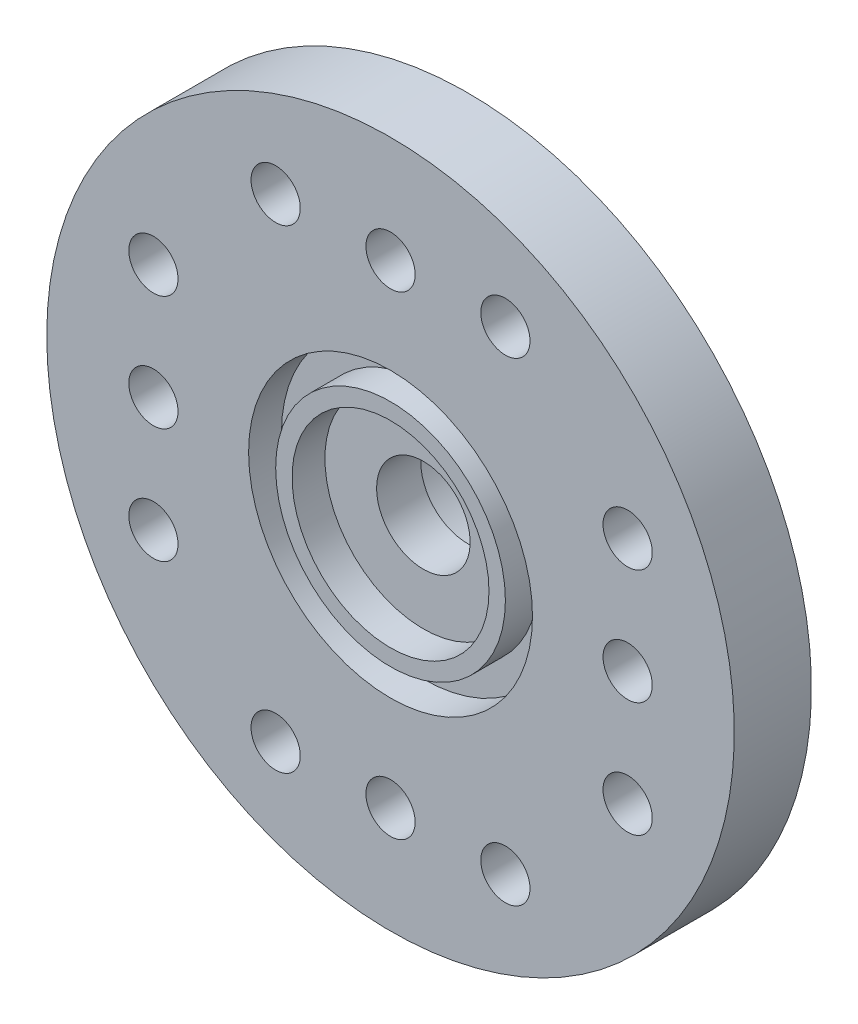
ISO-10303-21;
HEADER;
FILE_DESCRIPTION(('STEP AP214'),'2;1');
FILE_NAME('part.step','',(''),(''),'','','');
FILE_SCHEMA(('AUTOMOTIVE_DESIGN { 1 0 10303 214 1 1 1 1 }'));
ENDSEC;
DATA;
#1=APPLICATION_CONTEXT('core data for automotive mechanical design processes');
#2=APPLICATION_PROTOCOL_DEFINITION('international standard','automotive_design',2000,#1);
#3=PRODUCT_CONTEXT('',#1,'mechanical');
#4=PRODUCT('Part','Part','',(#3));
#5=PRODUCT_RELATED_PRODUCT_CATEGORY('part','',(#4));
#6=PRODUCT_DEFINITION_FORMATION('','',#4);
#7=PRODUCT_DEFINITION_CONTEXT('part definition',#1,'design');
#8=PRODUCT_DEFINITION('design','',#6,#7);
#9=PRODUCT_DEFINITION_SHAPE('','',#8);
#10=(LENGTH_UNIT() NAMED_UNIT(*) SI_UNIT(.MILLI.,.METRE.));
#11=(NAMED_UNIT(*) PLANE_ANGLE_UNIT() SI_UNIT($,.RADIAN.));
#12=(NAMED_UNIT(*) SI_UNIT($,.STERADIAN.) SOLID_ANGLE_UNIT());
#13=UNCERTAINTY_MEASURE_WITH_UNIT(LENGTH_MEASURE(1.E-05),#10,'distance_accuracy_value','');
#14=(GEOMETRIC_REPRESENTATION_CONTEXT(3) GLOBAL_UNCERTAINTY_ASSIGNED_CONTEXT((#13)) GLOBAL_UNIT_ASSIGNED_CONTEXT((#10,
#11,#12)) REPRESENTATION_CONTEXT('',''));
#15=CARTESIAN_POINT('',(0.,0.,0.));
#16=DIRECTION('',(0.,0.,1.));
#17=DIRECTION('',(1.,0.,0.));
#18=AXIS2_PLACEMENT_3D('',#15,#16,#17);
#19=CARTESIAN_POINT('',(0.,0.,2.35));
#20=DIRECTION('',(0.,0.,-1.));
#21=DIRECTION('',(-1.,0.,0.));
#22=AXIS2_PLACEMENT_3D('',#19,#20,#21);
#23=CYLINDRICAL_SURFACE('',#22,1.425);
#24=CARTESIAN_POINT('',(0.,0.,0.));
#25=DIRECTION('',(0.,0.,-1.));
#26=DIRECTION('',(-1.,0.,0.));
#27=AXIS2_PLACEMENT_3D('',#24,#25,#26);
#28=CIRCLE('',#27,1.425);
#29=CARTESIAN_POINT('',(-1.425,0.,0.));
#30=VERTEX_POINT('',#29);
#31=EDGE_CURVE('E18',#30,#30,#28,.T.);
#32=ORIENTED_EDGE('',*,*,#31,.T.);
#33=EDGE_LOOP('',(#32));
#34=FACE_BOUND('',#33,.T.);
#35=CARTESIAN_POINT('',(0.,0.,1.35));
#36=DIRECTION('',(0.,0.,-1.));
#37=DIRECTION('',(-1.,0.,0.));
#38=AXIS2_PLACEMENT_3D('',#35,#36,#37);
#39=CIRCLE('',#38,1.425);
#40=CARTESIAN_POINT('',(-1.425,0.,1.35));
#41=VERTEX_POINT('',#40);
#42=EDGE_CURVE('E132',#41,#41,#39,.T.);
#43=ORIENTED_EDGE('',*,*,#42,.F.);
#44=EDGE_LOOP('',(#43));
#45=FACE_BOUND('',#44,.T.);
#46=ADVANCED_FACE('F15',(#34,#45),#23,.F.);
#47=CARTESIAN_POINT('',(0.,0.,0.));
#48=DIRECTION('',(0.,0.,1.));
#49=DIRECTION('',(1.,0.,0.));
#50=AXIS2_PLACEMENT_3D('',#47,#48,#49);
#51=PLANE('',#50);
#52=ORIENTED_EDGE('',*,*,#31,.F.);
#53=EDGE_LOOP('',(#52));
#54=FACE_BOUND('',#53,.T.);
#55=CARTESIAN_POINT('',(0.,0.,0.));
#56=DIRECTION('',(0.,0.,1.));
#57=DIRECTION('',(1.,0.,0.));
#58=AXIS2_PLACEMENT_3D('',#55,#56,#57);
#59=CIRCLE('',#58,2.65);
#60=CARTESIAN_POINT('',(2.65,0.,0.));
#61=VERTEX_POINT('',#60);
#62=EDGE_CURVE('E130',#61,#61,#59,.F.);
#63=ORIENTED_EDGE('',*,*,#62,.T.);
#64=EDGE_LOOP('',(#63));
#65=FACE_BOUND('',#64,.T.);
#66=ADVANCED_FACE('F141',(#54,#65),#51,.F.);
#67=CARTESIAN_POINT('',(0.,0.,1.35));
#68=DIRECTION('',(0.,0.,1.));
#69=DIRECTION('',(1.,0.,0.));
#70=AXIS2_PLACEMENT_3D('',#67,#68,#69);
#71=PLANE('',#70);
#72=CARTESIAN_POINT('',(0.,0.,1.35));
#73=DIRECTION('',(0.,0.,1.));
#74=DIRECTION('',(1.,0.,0.));
#75=AXIS2_PLACEMENT_3D('',#72,#73,#74);
#76=CIRCLE('',#75,3.);
#77=CARTESIAN_POINT('',(3.,0.,1.35));
#78=VERTEX_POINT('',#77);
#79=EDGE_CURVE('E127',#78,#78,#76,.T.);
#80=ORIENTED_EDGE('',*,*,#79,.T.);
#81=EDGE_LOOP('',(#80));
#82=FACE_BOUND('',#81,.T.);
#83=ORIENTED_EDGE('',*,*,#42,.T.);
#84=EDGE_LOOP('',(#83));
#85=FACE_BOUND('',#84,.T.);
#86=ADVANCED_FACE('F144',(#82,#85),#71,.T.);
#87=CARTESIAN_POINT('',(0.,0.,-3.5));
#88=DIRECTION('',(0.,0.,1.));
#89=DIRECTION('',(1.,0.,0.));
#90=AXIS2_PLACEMENT_3D('',#87,#88,#89);
#91=CYLINDRICAL_SURFACE('',#90,2.65);
#92=CARTESIAN_POINT('',(0.,0.,-3.5));
#93=DIRECTION('',(0.,0.,1.));
#94=DIRECTION('',(1.,0.,0.));
#95=AXIS2_PLACEMENT_3D('',#92,#93,#94);
#96=CIRCLE('',#95,2.65);
#97=CARTESIAN_POINT('',(2.65,0.,-3.5));
#98=VERTEX_POINT('',#97);
#99=EDGE_CURVE('E124',#98,#98,#96,.T.);
#100=ORIENTED_EDGE('',*,*,#99,.F.);
#101=EDGE_LOOP('',(#100));
#102=FACE_BOUND('',#101,.T.);
#103=ORIENTED_EDGE('',*,*,#62,.F.);
#104=EDGE_LOOP('',(#103));
#105=FACE_BOUND('',#104,.T.);
#106=ADVANCED_FACE('F147',(#102,#105),#91,.F.);
#107=CARTESIAN_POINT('',(0.,0.,1.35));
#108=DIRECTION('',(0.,0.,1.));
#109=DIRECTION('',(1.,0.,0.));
#110=AXIS2_PLACEMENT_3D('',#107,#108,#109);
#111=CYLINDRICAL_SURFACE('',#110,3.);
#112=CARTESIAN_POINT('',(0.,0.,2.35));
#113=DIRECTION('',(0.,0.,1.));
#114=DIRECTION('',(1.,0.,0.));
#115=AXIS2_PLACEMENT_3D('',#112,#113,#114);
#116=CIRCLE('',#115,3.);
#117=CARTESIAN_POINT('',(3.,0.,2.35));
#118=VERTEX_POINT('',#117);
#119=EDGE_CURVE('E121',#118,#118,#116,.F.);
#120=ORIENTED_EDGE('',*,*,#119,.F.);
#121=EDGE_LOOP('',(#120));
#122=FACE_BOUND('',#121,.T.);
#123=ORIENTED_EDGE('',*,*,#79,.F.);
#124=EDGE_LOOP('',(#123));
#125=FACE_BOUND('',#124,.T.);
#126=ADVANCED_FACE('F149',(#122,#125),#111,.F.);
#127=CARTESIAN_POINT('',(0.,0.,-3.5));
#128=DIRECTION('',(0.,0.,-1.));
#129=DIRECTION('',(-1.,0.,0.));
#130=AXIS2_PLACEMENT_3D('',#127,#128,#129);
#131=PLANE('',#130);
#132=ORIENTED_EDGE('',*,*,#99,.T.);
#133=EDGE_LOOP('',(#132));
#134=FACE_BOUND('',#133,.T.);
#135=CARTESIAN_POINT('',(0.,0.,-3.49999999997408));
#136=DIRECTION('',(0.,0.,1.));
#137=DIRECTION('',(0.,-1.,0.));
#138=AXIS2_PLACEMENT_3D('',#135,#136,#137);
#139=CIRCLE('',#138,4.14999999998145);
#140=CARTESIAN_POINT('',(0.,-4.14999999998145,-3.49999999997408));
#141=VERTEX_POINT('',#140);
#142=EDGE_CURVE('E118',#141,#141,#139,.T.);
#143=ORIENTED_EDGE('',*,*,#142,.F.);
#144=EDGE_LOOP('',(#143));
#145=FACE_BOUND('',#144,.T.);
#146=ADVANCED_FACE('F157',(#134,#145),#131,.T.);
#147=CARTESIAN_POINT('',(0.,0.,2.35));
#148=DIRECTION('',(0.,0.,1.));
#149=DIRECTION('',(1.,0.,0.));
#150=AXIS2_PLACEMENT_3D('',#147,#148,#149);
#151=PLANE('',#150);
#152=CARTESIAN_POINT('',(0.,0.,2.35));
#153=DIRECTION('',(0.,0.,1.));
#154=DIRECTION('',(1.,0.,0.));
#155=AXIS2_PLACEMENT_3D('',#152,#153,#154);
#156=CIRCLE('',#155,3.5);
#157=CARTESIAN_POINT('',(3.5,0.,2.35));
#158=VERTEX_POINT('',#157);
#159=EDGE_CURVE('E115',#158,#158,#156,.F.);
#160=ORIENTED_EDGE('',*,*,#159,.F.);
#161=EDGE_LOOP('',(#160));
#162=FACE_BOUND('',#161,.T.);
#163=ORIENTED_EDGE('',*,*,#119,.T.);
#164=EDGE_LOOP('',(#163));
#165=FACE_BOUND('',#164,.T.);
#166=ADVANCED_FACE('F245',(#162,#165),#151,.T.);
#167=CARTESIAN_POINT('',(0.,0.,-3.24999999992315));
#168=DIRECTION('',(0.,0.,1.));
#169=DIRECTION('',(0.,-1.,0.));
#170=AXIS2_PLACEMENT_3D('',#167,#168,#169);
#171=CONICAL_SURFACE('',#170,4.39999999997553,0.785398163283761);
#172=ORIENTED_EDGE('',*,*,#142,.T.);
#173=EDGE_LOOP('',(#172));
#174=FACE_BOUND('',#173,.T.);
#175=CARTESIAN_POINT('',(0.,0.,-3.25));
#176=DIRECTION('',(0.,0.,1.));
#177=DIRECTION('',(1.,0.,0.));
#178=AXIS2_PLACEMENT_3D('',#175,#176,#177);
#179=CIRCLE('',#178,4.4);
#180=CARTESIAN_POINT('',(4.4,0.,-3.25));
#181=VERTEX_POINT('',#180);
#182=EDGE_CURVE('E30',#181,#181,#179,.T.);
#183=ORIENTED_EDGE('',*,*,#182,.F.);
#184=EDGE_LOOP('',(#183));
#185=FACE_BOUND('',#184,.T.);
#186=ADVANCED_FACE('F241',(#174,#185),#171,.T.);
#187=CARTESIAN_POINT('',(0.,0.,1.35));
#188=DIRECTION('',(0.,0.,1.));
#189=DIRECTION('',(1.,0.,0.));
#190=AXIS2_PLACEMENT_3D('',#187,#188,#189);
#191=CYLINDRICAL_SURFACE('',#190,3.5);
#192=CARTESIAN_POINT('',(0.,0.,1.35));
#193=DIRECTION('',(0.,0.,1.));
#194=DIRECTION('',(1.,0.,0.));
#195=AXIS2_PLACEMENT_3D('',#192,#193,#194);
#196=CIRCLE('',#195,3.5);
#197=CARTESIAN_POINT('',(3.5,0.,1.35));
#198=VERTEX_POINT('',#197);
#199=EDGE_CURVE('E112',#198,#198,#196,.F.);
#200=ORIENTED_EDGE('',*,*,#199,.F.);
#201=EDGE_LOOP('',(#200));
#202=FACE_BOUND('',#201,.T.);
#203=ORIENTED_EDGE('',*,*,#159,.T.);
#204=EDGE_LOOP('',(#203));
#205=FACE_BOUND('',#204,.T.);
#206=ADVANCED_FACE('F237',(#202,#205),#191,.T.);
#207=CARTESIAN_POINT('',(0.,0.,-3.5));
#208=DIRECTION('',(0.,0.,1.));
#209=DIRECTION('',(1.,0.,0.));
#210=AXIS2_PLACEMENT_3D('',#207,#208,#209);
#211=CYLINDRICAL_SURFACE('',#210,4.4);
#212=ORIENTED_EDGE('',*,*,#182,.T.);
#213=EDGE_LOOP('',(#212));
#214=FACE_BOUND('',#213,.T.);
#215=CARTESIAN_POINT('',(0.,0.,0.));
#216=DIRECTION('',(0.,0.,1.));
#217=DIRECTION('',(1.,0.,0.));
#218=AXIS2_PLACEMENT_3D('',#215,#216,#217);
#219=CIRCLE('',#218,4.4);
#220=CARTESIAN_POINT('',(4.4,0.,0.));
#221=VERTEX_POINT('',#220);
#222=EDGE_CURVE('E109',#221,#221,#219,.F.);
#223=ORIENTED_EDGE('',*,*,#222,.T.);
#224=EDGE_LOOP('',(#223));
#225=FACE_BOUND('',#224,.T.);
#226=ADVANCED_FACE('F233',(#214,#225),#211,.T.);
#227=CARTESIAN_POINT('',(0.,0.,1.35));
#228=DIRECTION('',(0.,0.,1.));
#229=DIRECTION('',(1.,0.,0.));
#230=AXIS2_PLACEMENT_3D('',#227,#228,#229);
#231=PLANE('',#230);
#232=CARTESIAN_POINT('',(0.,0.,1.35));
#233=DIRECTION('',(0.,0.,1.));
#234=DIRECTION('',(1.,0.,0.));
#235=AXIS2_PLACEMENT_3D('',#232,#233,#234);
#236=CIRCLE('',#235,4.325);
#237=CARTESIAN_POINT('',(4.325,0.,1.35));
#238=VERTEX_POINT('',#237);
#239=EDGE_CURVE('E106',#238,#238,#236,.T.);
#240=ORIENTED_EDGE('',*,*,#239,.T.);
#241=EDGE_LOOP('',(#240));
#242=FACE_BOUND('',#241,.T.);
#243=ORIENTED_EDGE('',*,*,#199,.T.);
#244=EDGE_LOOP('',(#243));
#245=FACE_BOUND('',#244,.T.);
#246=ADVANCED_FACE('F229',(#242,#245),#231,.T.);
#247=CARTESIAN_POINT('',(0.,0.,0.));
#248=DIRECTION('',(0.,0.,1.));
#249=DIRECTION('',(1.,0.,0.));
#250=AXIS2_PLACEMENT_3D('',#247,#248,#249);
#251=PLANE('',#250);
#252=ORIENTED_EDGE('',*,*,#222,.F.);
#253=EDGE_LOOP('',(#252));
#254=FACE_BOUND('',#253,.T.);
#255=CARTESIAN_POINT('',(0.,7.225,0.));
#256=DIRECTION('',(0.,0.,-1.));
#257=DIRECTION('',(-1.,0.,0.));
#258=AXIS2_PLACEMENT_3D('',#255,#256,#257);
#259=CIRCLE('',#258,0.75);
#260=CARTESIAN_POINT('',(-0.750000000000002,7.225,0.));
#261=VERTEX_POINT('',#260);
#262=EDGE_CURVE('E67',#261,#261,#259,.F.);
#263=ORIENTED_EDGE('',*,*,#262,.T.);
#264=EDGE_LOOP('',(#263));
#265=FACE_BOUND('',#264,.T.);
#266=CARTESIAN_POINT('',(-7.225,3.5,0.));
#267=DIRECTION('',(0.,0.,-1.));
#268=DIRECTION('',(-1.,0.,0.));
#269=AXIS2_PLACEMENT_3D('',#266,#267,#268);
#270=CIRCLE('',#269,0.749999999999998);
#271=CARTESIAN_POINT('',(-7.975,3.5,0.));
#272=VERTEX_POINT('',#271);
#273=EDGE_CURVE('E70',#272,#272,#270,.F.);
#274=ORIENTED_EDGE('',*,*,#273,.T.);
#275=EDGE_LOOP('',(#274));
#276=FACE_BOUND('',#275,.T.);
#277=CARTESIAN_POINT('',(-7.225,-3.5,0.));
#278=DIRECTION('',(0.,0.,-1.));
#279=DIRECTION('',(-1.,0.,0.));
#280=AXIS2_PLACEMENT_3D('',#277,#278,#279);
#281=CIRCLE('',#280,0.749999999999998);
#282=CARTESIAN_POINT('',(-7.975,-3.5,0.));
#283=VERTEX_POINT('',#282);
#284=EDGE_CURVE('E73',#283,#283,#281,.F.);
#285=ORIENTED_EDGE('',*,*,#284,.T.);
#286=EDGE_LOOP('',(#285));
#287=FACE_BOUND('',#286,.T.);
#288=CARTESIAN_POINT('',(0.,-7.225,0.));
#289=DIRECTION('',(0.,0.,-1.));
#290=DIRECTION('',(-1.,0.,0.));
#291=AXIS2_PLACEMENT_3D('',#288,#289,#290);
#292=CIRCLE('',#291,0.749999999999998);
#293=CARTESIAN_POINT('',(-0.749999999999998,-7.225,0.));
#294=VERTEX_POINT('',#293);
#295=EDGE_CURVE('E76',#294,#294,#292,.F.);
#296=ORIENTED_EDGE('',*,*,#295,.T.);
#297=EDGE_LOOP('',(#296));
#298=FACE_BOUND('',#297,.T.);
#299=CARTESIAN_POINT('',(7.225,-3.5,0.));
#300=DIRECTION('',(0.,0.,-1.));
#301=DIRECTION('',(-1.,0.,0.));
#302=AXIS2_PLACEMENT_3D('',#299,#300,#301);
#303=CIRCLE('',#302,0.75);
#304=CARTESIAN_POINT('',(6.475,-3.5,0.));
#305=VERTEX_POINT('',#304);
#306=EDGE_CURVE('E79',#305,#305,#303,.F.);
#307=ORIENTED_EDGE('',*,*,#306,.T.);
#308=EDGE_LOOP('',(#307));
#309=FACE_BOUND('',#308,.T.);
#310=CARTESIAN_POINT('',(7.225,3.5,0.));
#311=DIRECTION('',(0.,0.,-1.));
#312=DIRECTION('',(-1.,0.,0.));
#313=AXIS2_PLACEMENT_3D('',#310,#311,#312);
#314=CIRCLE('',#313,0.75);
#315=CARTESIAN_POINT('',(6.475,3.5,0.));
#316=VERTEX_POINT('',#315);
#317=EDGE_CURVE('E82',#316,#316,#314,.F.);
#318=ORIENTED_EDGE('',*,*,#317,.T.);
#319=EDGE_LOOP('',(#318));
#320=FACE_BOUND('',#319,.T.);
#321=CARTESIAN_POINT('',(0.,0.,0.));
#322=DIRECTION('',(0.,0.,-1.));
#323=DIRECTION('',(-1.,0.,0.));
#324=AXIS2_PLACEMENT_3D('',#321,#322,#323);
#325=CIRCLE('',#324,10.475);
#326=CARTESIAN_POINT('',(-10.475,0.,0.));
#327=VERTEX_POINT('',#326);
#328=EDGE_CURVE('E85',#327,#327,#325,.F.);
#329=ORIENTED_EDGE('',*,*,#328,.F.);
#330=EDGE_LOOP('',(#329));
#331=FACE_BOUND('',#330,.T.);
#332=CARTESIAN_POINT('',(7.225,0.,0.));
#333=DIRECTION('',(0.,0.,-1.));
#334=DIRECTION('',(-1.,0.,0.));
#335=AXIS2_PLACEMENT_3D('',#332,#333,#334);
#336=CIRCLE('',#335,0.75);
#337=CARTESIAN_POINT('',(6.475,0.,0.));
#338=VERTEX_POINT('',#337);
#339=EDGE_CURVE('E88',#338,#338,#336,.F.);
#340=ORIENTED_EDGE('',*,*,#339,.T.);
#341=EDGE_LOOP('',(#340));
#342=FACE_BOUND('',#341,.T.);
#343=CARTESIAN_POINT('',(3.5,-7.225,0.));
#344=DIRECTION('',(0.,0.,-1.));
#345=DIRECTION('',(-1.,0.,0.));
#346=AXIS2_PLACEMENT_3D('',#343,#344,#345);
#347=CIRCLE('',#346,0.749999999999999);
#348=CARTESIAN_POINT('',(2.75,-7.225,0.));
#349=VERTEX_POINT('',#348);
#350=EDGE_CURVE('E91',#349,#349,#347,.F.);
#351=ORIENTED_EDGE('',*,*,#350,.T.);
#352=EDGE_LOOP('',(#351));
#353=FACE_BOUND('',#352,.T.);
#354=CARTESIAN_POINT('',(-3.5,-7.225,0.));
#355=DIRECTION('',(0.,0.,-1.));
#356=DIRECTION('',(-1.,0.,0.));
#357=AXIS2_PLACEMENT_3D('',#354,#355,#356);
#358=CIRCLE('',#357,0.749999999999998);
#359=CARTESIAN_POINT('',(-4.25,-7.225,0.));
#360=VERTEX_POINT('',#359);
#361=EDGE_CURVE('E94',#360,#360,#358,.F.);
#362=ORIENTED_EDGE('',*,*,#361,.T.);
#363=EDGE_LOOP('',(#362));
#364=FACE_BOUND('',#363,.T.);
#365=CARTESIAN_POINT('',(-7.225,0.,0.));
#366=DIRECTION('',(0.,0.,-1.));
#367=DIRECTION('',(-1.,0.,0.));
#368=AXIS2_PLACEMENT_3D('',#365,#366,#367);
#369=CIRCLE('',#368,0.749999999999998);
#370=CARTESIAN_POINT('',(-7.975,0.,0.));
#371=VERTEX_POINT('',#370);
#372=EDGE_CURVE('E97',#371,#371,#369,.F.);
#373=ORIENTED_EDGE('',*,*,#372,.T.);
#374=EDGE_LOOP('',(#373));
#375=FACE_BOUND('',#374,.T.);
#376=CARTESIAN_POINT('',(-3.5,7.225,0.));
#377=DIRECTION('',(0.,0.,-1.));
#378=DIRECTION('',(-1.,0.,0.));
#379=AXIS2_PLACEMENT_3D('',#376,#377,#378);
#380=CIRCLE('',#379,0.749999999999999);
#381=CARTESIAN_POINT('',(-4.25,7.225,0.));
#382=VERTEX_POINT('',#381);
#383=EDGE_CURVE('E100',#382,#382,#380,.F.);
#384=ORIENTED_EDGE('',*,*,#383,.T.);
#385=EDGE_LOOP('',(#384));
#386=FACE_BOUND('',#385,.T.);
#387=CARTESIAN_POINT('',(3.5,7.225,0.));
#388=DIRECTION('',(0.,0.,-1.));
#389=DIRECTION('',(-1.,0.,0.));
#390=AXIS2_PLACEMENT_3D('',#387,#388,#389);
#391=CIRCLE('',#390,0.749999999999998);
#392=CARTESIAN_POINT('',(2.75,7.225,0.));
#393=VERTEX_POINT('',#392);
#394=EDGE_CURVE('E103',#393,#393,#391,.F.);
#395=ORIENTED_EDGE('',*,*,#394,.T.);
#396=EDGE_LOOP('',(#395));
#397=FACE_BOUND('',#396,.T.);
#398=ADVANCED_FACE('F225',(#254,#265,#276,#287,#298,#309,#320,#331,#342,#353,#364,#375,#386,
#397),#251,.F.);
#399=CARTESIAN_POINT('',(0.,0.,1.35));
#400=DIRECTION('',(0.,0.,1.));
#401=DIRECTION('',(1.,0.,0.));
#402=AXIS2_PLACEMENT_3D('',#399,#400,#401);
#403=CYLINDRICAL_SURFACE('',#402,4.325);
#404=CARTESIAN_POINT('',(0.,0.,2.35));
#405=DIRECTION('',(0.,0.,1.));
#406=DIRECTION('',(1.,0.,0.));
#407=AXIS2_PLACEMENT_3D('',#404,#405,#406);
#408=CIRCLE('',#407,4.325);
#409=CARTESIAN_POINT('',(4.325,0.,2.35));
#410=VERTEX_POINT('',#409);
#411=EDGE_CURVE('E64',#410,#410,#408,.F.);
#412=ORIENTED_EDGE('',*,*,#411,.F.);
#413=EDGE_LOOP('',(#412));
#414=FACE_BOUND('',#413,.T.);
#415=ORIENTED_EDGE('',*,*,#239,.F.);
#416=EDGE_LOOP('',(#415));
#417=FACE_BOUND('',#416,.T.);
#418=ADVANCED_FACE('F221',(#414,#417),#403,.F.);
#419=CARTESIAN_POINT('',(3.5,7.225,2.35));
#420=DIRECTION('',(0.,0.,-1.));
#421=DIRECTION('',(-1.,0.,0.));
#422=AXIS2_PLACEMENT_3D('',#419,#420,#421);
#423=CYLINDRICAL_SURFACE('',#422,0.749999999999998);
#424=CARTESIAN_POINT('',(3.5,7.225,2.35));
#425=DIRECTION('',(0.,0.,-1.));
#426=DIRECTION('',(-1.,0.,0.));
#427=AXIS2_PLACEMENT_3D('',#424,#425,#426);
#428=CIRCLE('',#427,0.749999999999998);
#429=CARTESIAN_POINT('',(2.75,7.225,2.35));
#430=VERTEX_POINT('',#429);
#431=EDGE_CURVE('E61',#430,#430,#428,.T.);
#432=ORIENTED_EDGE('',*,*,#431,.F.);
#433=EDGE_LOOP('',(#432));
#434=FACE_BOUND('',#433,.T.);
#435=ORIENTED_EDGE('',*,*,#394,.F.);
#436=EDGE_LOOP('',(#435));
#437=FACE_BOUND('',#436,.T.);
#438=ADVANCED_FACE('F217',(#434,#437),#423,.F.);
#439=CARTESIAN_POINT('',(-3.5,7.225,2.35));
#440=DIRECTION('',(0.,0.,-1.));
#441=DIRECTION('',(-1.,0.,0.));
#442=AXIS2_PLACEMENT_3D('',#439,#440,#441);
#443=CYLINDRICAL_SURFACE('',#442,0.749999999999999);
#444=CARTESIAN_POINT('',(-3.5,7.225,2.35));
#445=DIRECTION('',(0.,0.,-1.));
#446=DIRECTION('',(-1.,0.,0.));
#447=AXIS2_PLACEMENT_3D('',#444,#445,#446);
#448=CIRCLE('',#447,0.749999999999999);
#449=CARTESIAN_POINT('',(-4.25,7.225,2.35));
#450=VERTEX_POINT('',#449);
#451=EDGE_CURVE('E58',#450,#450,#448,.T.);
#452=ORIENTED_EDGE('',*,*,#451,.F.);
#453=EDGE_LOOP('',(#452));
#454=FACE_BOUND('',#453,.T.);
#455=ORIENTED_EDGE('',*,*,#383,.F.);
#456=EDGE_LOOP('',(#455));
#457=FACE_BOUND('',#456,.T.);
#458=ADVANCED_FACE('F213',(#454,#457),#443,.F.);
#459=CARTESIAN_POINT('',(-7.225,0.,2.35));
#460=DIRECTION('',(0.,0.,-1.));
#461=DIRECTION('',(-1.,0.,0.));
#462=AXIS2_PLACEMENT_3D('',#459,#460,#461);
#463=CYLINDRICAL_SURFACE('',#462,0.749999999999998);
#464=CARTESIAN_POINT('',(-7.225,0.,2.35));
#465=DIRECTION('',(0.,0.,-1.));
#466=DIRECTION('',(-1.,0.,0.));
#467=AXIS2_PLACEMENT_3D('',#464,#465,#466);
#468=CIRCLE('',#467,0.749999999999998);
#469=CARTESIAN_POINT('',(-7.975,0.,2.35));
#470=VERTEX_POINT('',#469);
#471=EDGE_CURVE('E55',#470,#470,#468,.T.);
#472=ORIENTED_EDGE('',*,*,#471,.F.);
#473=EDGE_LOOP('',(#472));
#474=FACE_BOUND('',#473,.T.);
#475=ORIENTED_EDGE('',*,*,#372,.F.);
#476=EDGE_LOOP('',(#475));
#477=FACE_BOUND('',#476,.T.);
#478=ADVANCED_FACE('F209',(#474,#477),#463,.F.);
#479=CARTESIAN_POINT('',(-3.5,-7.225,2.35));
#480=DIRECTION('',(0.,0.,-1.));
#481=DIRECTION('',(-1.,0.,0.));
#482=AXIS2_PLACEMENT_3D('',#479,#480,#481);
#483=CYLINDRICAL_SURFACE('',#482,0.749999999999998);
#484=CARTESIAN_POINT('',(-3.5,-7.225,2.35));
#485=DIRECTION('',(0.,0.,-1.));
#486=DIRECTION('',(-1.,0.,0.));
#487=AXIS2_PLACEMENT_3D('',#484,#485,#486);
#488=CIRCLE('',#487,0.749999999999998);
#489=CARTESIAN_POINT('',(-4.25,-7.225,2.35));
#490=VERTEX_POINT('',#489);
#491=EDGE_CURVE('E52',#490,#490,#488,.T.);
#492=ORIENTED_EDGE('',*,*,#491,.F.);
#493=EDGE_LOOP('',(#492));
#494=FACE_BOUND('',#493,.T.);
#495=ORIENTED_EDGE('',*,*,#361,.F.);
#496=EDGE_LOOP('',(#495));
#497=FACE_BOUND('',#496,.T.);
#498=ADVANCED_FACE('F205',(#494,#497),#483,.F.);
#499=CARTESIAN_POINT('',(3.5,-7.225,2.35));
#500=DIRECTION('',(0.,0.,-1.));
#501=DIRECTION('',(-1.,0.,0.));
#502=AXIS2_PLACEMENT_3D('',#499,#500,#501);
#503=CYLINDRICAL_SURFACE('',#502,0.749999999999999);
#504=CARTESIAN_POINT('',(3.5,-7.225,2.35));
#505=DIRECTION('',(0.,0.,-1.));
#506=DIRECTION('',(-1.,0.,0.));
#507=AXIS2_PLACEMENT_3D('',#504,#505,#506);
#508=CIRCLE('',#507,0.749999999999999);
#509=CARTESIAN_POINT('',(2.75,-7.225,2.35));
#510=VERTEX_POINT('',#509);
#511=EDGE_CURVE('E49',#510,#510,#508,.T.);
#512=ORIENTED_EDGE('',*,*,#511,.F.);
#513=EDGE_LOOP('',(#512));
#514=FACE_BOUND('',#513,.T.);
#515=ORIENTED_EDGE('',*,*,#350,.F.);
#516=EDGE_LOOP('',(#515));
#517=FACE_BOUND('',#516,.T.);
#518=ADVANCED_FACE('F201',(#514,#517),#503,.F.);
#519=CARTESIAN_POINT('',(7.225,0.,2.35));
#520=DIRECTION('',(0.,0.,-1.));
#521=DIRECTION('',(-1.,0.,0.));
#522=AXIS2_PLACEMENT_3D('',#519,#520,#521);
#523=CYLINDRICAL_SURFACE('',#522,0.75);
#524=CARTESIAN_POINT('',(7.225,0.,2.35));
#525=DIRECTION('',(0.,0.,-1.));
#526=DIRECTION('',(-1.,0.,0.));
#527=AXIS2_PLACEMENT_3D('',#524,#525,#526);
#528=CIRCLE('',#527,0.75);
#529=CARTESIAN_POINT('',(6.475,0.,2.35));
#530=VERTEX_POINT('',#529);
#531=EDGE_CURVE('E46',#530,#530,#528,.T.);
#532=ORIENTED_EDGE('',*,*,#531,.F.);
#533=EDGE_LOOP('',(#532));
#534=FACE_BOUND('',#533,.T.);
#535=ORIENTED_EDGE('',*,*,#339,.F.);
#536=EDGE_LOOP('',(#535));
#537=FACE_BOUND('',#536,.T.);
#538=ADVANCED_FACE('F197',(#534,#537),#523,.F.);
#539=CARTESIAN_POINT('',(0.,0.,2.35));
#540=DIRECTION('',(0.,0.,-1.));
#541=DIRECTION('',(-1.,0.,0.));
#542=AXIS2_PLACEMENT_3D('',#539,#540,#541);
#543=CYLINDRICAL_SURFACE('',#542,10.475);
#544=ORIENTED_EDGE('',*,*,#328,.T.);
#545=EDGE_LOOP('',(#544));
#546=FACE_BOUND('',#545,.T.);
#547=CARTESIAN_POINT('',(0.,0.,2.35));
#548=DIRECTION('',(0.,0.,-1.));
#549=DIRECTION('',(-1.,0.,0.));
#550=AXIS2_PLACEMENT_3D('',#547,#548,#549);
#551=CIRCLE('',#550,10.475);
#552=CARTESIAN_POINT('',(-10.475,0.,2.35));
#553=VERTEX_POINT('',#552);
#554=EDGE_CURVE('E43',#553,#553,#551,.F.);
#555=ORIENTED_EDGE('',*,*,#554,.F.);
#556=EDGE_LOOP('',(#555));
#557=FACE_BOUND('',#556,.T.);
#558=ADVANCED_FACE('F193',(#546,#557),#543,.T.);
#559=CARTESIAN_POINT('',(7.225,3.5,2.35));
#560=DIRECTION('',(0.,0.,-1.));
#561=DIRECTION('',(-1.,0.,0.));
#562=AXIS2_PLACEMENT_3D('',#559,#560,#561);
#563=CYLINDRICAL_SURFACE('',#562,0.75);
#564=CARTESIAN_POINT('',(7.225,3.5,2.35));
#565=DIRECTION('',(0.,0.,-1.));
#566=DIRECTION('',(-1.,0.,0.));
#567=AXIS2_PLACEMENT_3D('',#564,#565,#566);
#568=CIRCLE('',#567,0.75);
#569=CARTESIAN_POINT('',(6.475,3.5,2.35));
#570=VERTEX_POINT('',#569);
#571=EDGE_CURVE('E40',#570,#570,#568,.T.);
#572=ORIENTED_EDGE('',*,*,#571,.F.);
#573=EDGE_LOOP('',(#572));
#574=FACE_BOUND('',#573,.T.);
#575=ORIENTED_EDGE('',*,*,#317,.F.);
#576=EDGE_LOOP('',(#575));
#577=FACE_BOUND('',#576,.T.);
#578=ADVANCED_FACE('F189',(#574,#577),#563,.F.);
#579=CARTESIAN_POINT('',(7.225,-3.5,2.35));
#580=DIRECTION('',(0.,0.,-1.));
#581=DIRECTION('',(-1.,0.,0.));
#582=AXIS2_PLACEMENT_3D('',#579,#580,#581);
#583=CYLINDRICAL_SURFACE('',#582,0.75);
#584=CARTESIAN_POINT('',(7.225,-3.5,2.35));
#585=DIRECTION('',(0.,0.,-1.));
#586=DIRECTION('',(-1.,0.,0.));
#587=AXIS2_PLACEMENT_3D('',#584,#585,#586);
#588=CIRCLE('',#587,0.75);
#589=CARTESIAN_POINT('',(6.475,-3.5,2.35));
#590=VERTEX_POINT('',#589);
#591=EDGE_CURVE('E37',#590,#590,#588,.T.);
#592=ORIENTED_EDGE('',*,*,#591,.F.);
#593=EDGE_LOOP('',(#592));
#594=FACE_BOUND('',#593,.T.);
#595=ORIENTED_EDGE('',*,*,#306,.F.);
#596=EDGE_LOOP('',(#595));
#597=FACE_BOUND('',#596,.T.);
#598=ADVANCED_FACE('F185',(#594,#597),#583,.F.);
#599=CARTESIAN_POINT('',(0.,-7.225,2.35));
#600=DIRECTION('',(0.,0.,-1.));
#601=DIRECTION('',(-1.,0.,0.));
#602=AXIS2_PLACEMENT_3D('',#599,#600,#601);
#603=CYLINDRICAL_SURFACE('',#602,0.749999999999998);
#604=CARTESIAN_POINT('',(0.,-7.225,2.35));
#605=DIRECTION('',(0.,0.,-1.));
#606=DIRECTION('',(-1.,0.,0.));
#607=AXIS2_PLACEMENT_3D('',#604,#605,#606);
#608=CIRCLE('',#607,0.749999999999998);
#609=CARTESIAN_POINT('',(-0.749999999999998,-7.225,2.35));
#610=VERTEX_POINT('',#609);
#611=EDGE_CURVE('E34',#610,#610,#608,.T.);
#612=ORIENTED_EDGE('',*,*,#611,.F.);
#613=EDGE_LOOP('',(#612));
#614=FACE_BOUND('',#613,.T.);
#615=ORIENTED_EDGE('',*,*,#295,.F.);
#616=EDGE_LOOP('',(#615));
#617=FACE_BOUND('',#616,.T.);
#618=ADVANCED_FACE('F181',(#614,#617),#603,.F.);
#619=CARTESIAN_POINT('',(-7.225,-3.5,2.35));
#620=DIRECTION('',(0.,0.,-1.));
#621=DIRECTION('',(-1.,0.,0.));
#622=AXIS2_PLACEMENT_3D('',#619,#620,#621);
#623=CYLINDRICAL_SURFACE('',#622,0.749999999999998);
#624=CARTESIAN_POINT('',(-7.225,-3.5,2.35));
#625=DIRECTION('',(0.,0.,-1.));
#626=DIRECTION('',(-1.,0.,0.));
#627=AXIS2_PLACEMENT_3D('',#624,#625,#626);
#628=CIRCLE('',#627,0.749999999999998);
#629=CARTESIAN_POINT('',(-7.975,-3.5,2.35));
#630=VERTEX_POINT('',#629);
#631=EDGE_CURVE('E27',#630,#630,#628,.T.);
#632=ORIENTED_EDGE('',*,*,#631,.F.);
#633=EDGE_LOOP('',(#632));
#634=FACE_BOUND('',#633,.T.);
#635=ORIENTED_EDGE('',*,*,#284,.F.);
#636=EDGE_LOOP('',(#635));
#637=FACE_BOUND('',#636,.T.);
#638=ADVANCED_FACE('F177',(#634,#637),#623,.F.);
#639=CARTESIAN_POINT('',(-7.225,3.5,2.35));
#640=DIRECTION('',(0.,0.,-1.));
#641=DIRECTION('',(-1.,0.,0.));
#642=AXIS2_PLACEMENT_3D('',#639,#640,#641);
#643=CYLINDRICAL_SURFACE('',#642,0.749999999999998);
#644=CARTESIAN_POINT('',(-7.225,3.5,2.35));
#645=DIRECTION('',(0.,0.,-1.));
#646=DIRECTION('',(-1.,0.,0.));
#647=AXIS2_PLACEMENT_3D('',#644,#645,#646);
#648=CIRCLE('',#647,0.749999999999998);
#649=CARTESIAN_POINT('',(-7.975,3.5,2.35));
#650=VERTEX_POINT('',#649);
#651=EDGE_CURVE('E22',#650,#650,#648,.T.);
#652=ORIENTED_EDGE('',*,*,#651,.F.);
#653=EDGE_LOOP('',(#652));
#654=FACE_BOUND('',#653,.T.);
#655=ORIENTED_EDGE('',*,*,#273,.F.);
#656=EDGE_LOOP('',(#655));
#657=FACE_BOUND('',#656,.T.);
#658=ADVANCED_FACE('F170',(#654,#657),#643,.F.);
#659=CARTESIAN_POINT('',(0.,7.225,2.35));
#660=DIRECTION('',(0.,0.,-1.));
#661=DIRECTION('',(-1.,0.,0.));
#662=AXIS2_PLACEMENT_3D('',#659,#660,#661);
#663=CYLINDRICAL_SURFACE('',#662,0.75);
#664=CARTESIAN_POINT('',(0.,7.225,2.35));
#665=DIRECTION('',(0.,0.,-1.));
#666=DIRECTION('',(-1.,0.,0.));
#667=AXIS2_PLACEMENT_3D('',#664,#665,#666);
#668=CIRCLE('',#667,0.75);
#669=CARTESIAN_POINT('',(-0.750000000000002,7.225,2.35));
#670=VERTEX_POINT('',#669);
#671=EDGE_CURVE('E10',#670,#670,#668,.T.);
#672=ORIENTED_EDGE('',*,*,#671,.F.);
#673=EDGE_LOOP('',(#672));
#674=FACE_BOUND('',#673,.T.);
#675=ORIENTED_EDGE('',*,*,#262,.F.);
#676=EDGE_LOOP('',(#675));
#677=FACE_BOUND('',#676,.T.);
#678=ADVANCED_FACE('F165',(#674,#677),#663,.F.);
#679=CARTESIAN_POINT('',(0.,0.,2.35));
#680=DIRECTION('',(0.,0.,1.));
#681=DIRECTION('',(1.,0.,0.));
#682=AXIS2_PLACEMENT_3D('',#679,#680,#681);
#683=PLANE('',#682);
#684=ORIENTED_EDGE('',*,*,#671,.T.);
#685=EDGE_LOOP('',(#684));
#686=FACE_BOUND('',#685,.T.);
#687=ORIENTED_EDGE('',*,*,#651,.T.);
#688=EDGE_LOOP('',(#687));
#689=FACE_BOUND('',#688,.T.);
#690=ORIENTED_EDGE('',*,*,#631,.T.);
#691=EDGE_LOOP('',(#690));
#692=FACE_BOUND('',#691,.T.);
#693=ORIENTED_EDGE('',*,*,#611,.T.);
#694=EDGE_LOOP('',(#693));
#695=FACE_BOUND('',#694,.T.);
#696=ORIENTED_EDGE('',*,*,#591,.T.);
#697=EDGE_LOOP('',(#696));
#698=FACE_BOUND('',#697,.T.);
#699=ORIENTED_EDGE('',*,*,#571,.T.);
#700=EDGE_LOOP('',(#699));
#701=FACE_BOUND('',#700,.T.);
#702=ORIENTED_EDGE('',*,*,#554,.T.);
#703=EDGE_LOOP('',(#702));
#704=FACE_BOUND('',#703,.T.);
#705=ORIENTED_EDGE('',*,*,#531,.T.);
#706=EDGE_LOOP('',(#705));
#707=FACE_BOUND('',#706,.T.);
#708=ORIENTED_EDGE('',*,*,#511,.T.);
#709=EDGE_LOOP('',(#708));
#710=FACE_BOUND('',#709,.T.);
#711=ORIENTED_EDGE('',*,*,#491,.T.);
#712=EDGE_LOOP('',(#711));
#713=FACE_BOUND('',#712,.T.);
#714=ORIENTED_EDGE('',*,*,#471,.T.);
#715=EDGE_LOOP('',(#714));
#716=FACE_BOUND('',#715,.T.);
#717=ORIENTED_EDGE('',*,*,#451,.T.);
#718=EDGE_LOOP('',(#717));
#719=FACE_BOUND('',#718,.T.);
#720=ORIENTED_EDGE('',*,*,#431,.T.);
#721=EDGE_LOOP('',(#720));
#722=FACE_BOUND('',#721,.T.);
#723=ORIENTED_EDGE('',*,*,#411,.T.);
#724=EDGE_LOOP('',(#723));
#725=FACE_BOUND('',#724,.T.);
#726=ADVANCED_FACE('F163',(#686,#689,#692,#695,#698,#701,#704,#707,#710,#713,#716,#719,#722,
#725),#683,.T.);
#727=CLOSED_SHELL('',(#46,#66,#86,#106,#126,#146,#166,#186,#206,#226,#246,#398,#418,#438,#458,
#478,#498,#518,#538,#558,#578,#598,#618,#638,#658,#678,#726));
#728=MANIFOLD_SOLID_BREP('B1',#727);
#729=ADVANCED_BREP_SHAPE_REPRESENTATION('',(#18,#728),#14);
#730=SHAPE_DEFINITION_REPRESENTATION(#9,#729);
ENDSEC;
END-ISO-10303-21;
